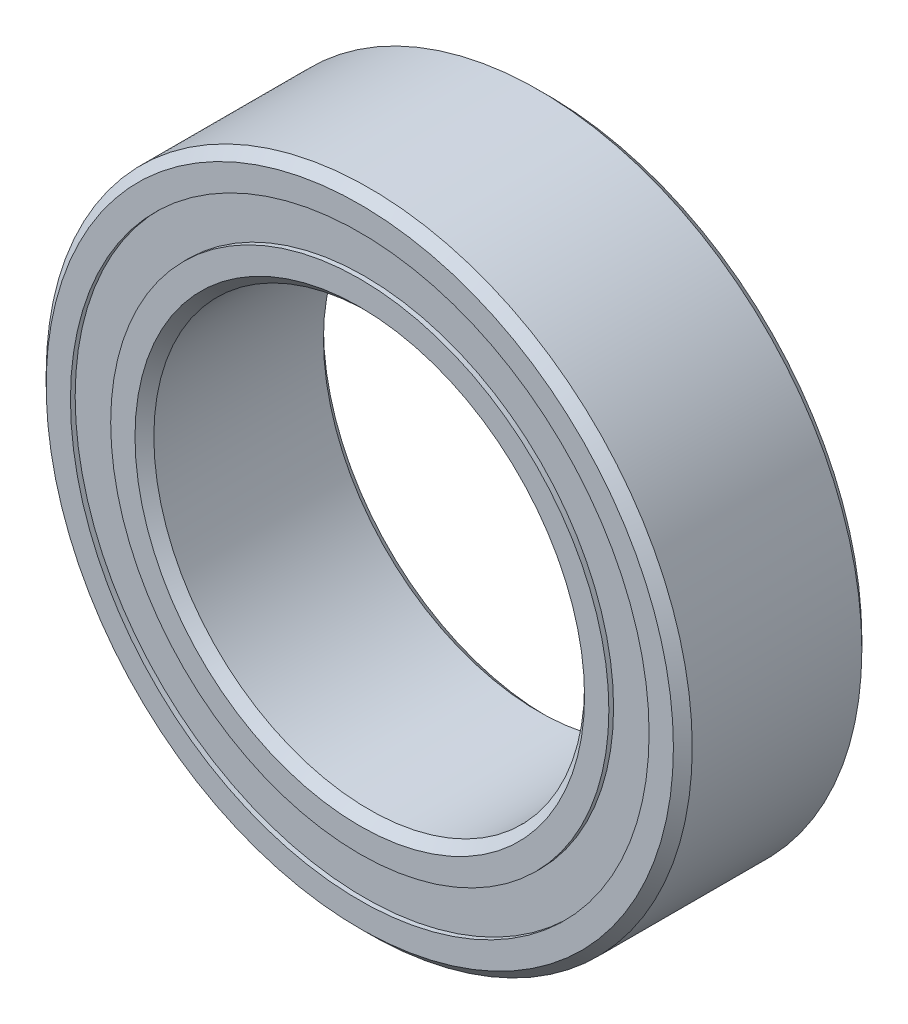
ISO-10303-21;
HEADER;
FILE_DESCRIPTION(('STEP AP214'),'2;1');
FILE_NAME('part.step','',(''),(''),'','','');
FILE_SCHEMA(('AUTOMOTIVE_DESIGN { 1 0 10303 214 1 1 1 1 }'));
ENDSEC;
DATA;
#1=APPLICATION_CONTEXT('core data for automotive mechanical design processes');
#2=APPLICATION_PROTOCOL_DEFINITION('international standard','automotive_design',2000,#1);
#3=PRODUCT_CONTEXT('',#1,'mechanical');
#4=PRODUCT('Part','Part','',(#3));
#5=PRODUCT_RELATED_PRODUCT_CATEGORY('part','',(#4));
#6=PRODUCT_DEFINITION_FORMATION('','',#4);
#7=PRODUCT_DEFINITION_CONTEXT('part definition',#1,'design');
#8=PRODUCT_DEFINITION('design','',#6,#7);
#9=PRODUCT_DEFINITION_SHAPE('','',#8);
#10=(LENGTH_UNIT() NAMED_UNIT(*) SI_UNIT(.MILLI.,.METRE.));
#11=(NAMED_UNIT(*) PLANE_ANGLE_UNIT() SI_UNIT($,.RADIAN.));
#12=(NAMED_UNIT(*) SI_UNIT($,.STERADIAN.) SOLID_ANGLE_UNIT());
#13=UNCERTAINTY_MEASURE_WITH_UNIT(LENGTH_MEASURE(1.E-05),#10,'distance_accuracy_value','');
#14=(GEOMETRIC_REPRESENTATION_CONTEXT(3) GLOBAL_UNCERTAINTY_ASSIGNED_CONTEXT((#13)) GLOBAL_UNIT_ASSIGNED_CONTEXT((#10,
#11,#12)) REPRESENTATION_CONTEXT('',''));
#15=CARTESIAN_POINT('',(0.,0.,0.));
#16=DIRECTION('',(0.,0.,1.));
#17=DIRECTION('',(1.,0.,0.));
#18=AXIS2_PLACEMENT_3D('',#15,#16,#17);
#19=CARTESIAN_POINT('',(0.,5.37362637362637,-1.6625));
#20=DIRECTION('',(0.,0.,1.));
#21=DIRECTION('',(1.,0.,0.));
#22=AXIS2_PLACEMENT_3D('',#19,#20,#21);
#23=PLANE('',#22);
#24=CARTESIAN_POINT('',(0.,0.,-1.6625));
#25=DIRECTION('',(0.,0.,1.));
#26=DIRECTION('',(1.,0.,0.));
#27=AXIS2_PLACEMENT_3D('',#24,#25,#26);
#28=CIRCLE('',#27,5.37362637362637);
#29=CARTESIAN_POINT('',(5.37362637362637,0.,-1.6625));
#30=VERTEX_POINT('',#29);
#31=EDGE_CURVE('E56',#30,#30,#28,.T.);
#32=ORIENTED_EDGE('',*,*,#31,.F.);
#33=EDGE_LOOP('',(#32));
#34=FACE_BOUND('',#33,.T.);
#35=CARTESIAN_POINT('',(0.,0.,-1.6625));
#36=DIRECTION('',(0.,0.,1.));
#37=DIRECTION('',(1.,0.,0.));
#38=AXIS2_PLACEMENT_3D('',#35,#36,#37);
#39=CIRCLE('',#38,4.62637362637363);
#40=CARTESIAN_POINT('',(4.62637362637363,0.,-1.6625));
#41=VERTEX_POINT('',#40);
#42=EDGE_CURVE('E11',#41,#41,#39,.T.);
#43=ORIENTED_EDGE('',*,*,#42,.T.);
#44=EDGE_LOOP('',(#43));
#45=FACE_BOUND('',#44,.T.);
#46=ADVANCED_FACE('F42',(#34,#45),#23,.F.);
#47=CARTESIAN_POINT('',(0.,0.,1.75));
#48=DIRECTION('',(0.,0.,1.));
#49=DIRECTION('',(1.,0.,0.));
#50=AXIS2_PLACEMENT_3D('',#47,#48,#49);
#51=CYLINDRICAL_SURFACE('',#50,4.62637362637363);
#52=ORIENTED_EDGE('',*,*,#42,.F.);
#53=EDGE_LOOP('',(#52));
#54=FACE_BOUND('',#53,.T.);
#55=CARTESIAN_POINT('',(0.,0.,-0.862864380232568));
#56=DIRECTION('',(0.,0.,1.));
#57=DIRECTION('',(1.,0.,0.));
#58=AXIS2_PLACEMENT_3D('',#55,#56,#57);
#59=CIRCLE('',#58,4.62637362637363);
#60=CARTESIAN_POINT('',(4.62637362637363,0.,-0.862864380232568));
#61=VERTEX_POINT('',#60);
#62=EDGE_CURVE('E48',#61,#61,#59,.T.);
#63=ORIENTED_EDGE('',*,*,#62,.T.);
#64=EDGE_LOOP('',(#63));
#65=FACE_BOUND('',#64,.T.);
#66=ADVANCED_FACE('F65',(#54,#65),#51,.F.);
#67=CARTESIAN_POINT('',(0.,5.37362637362637,-0.862864380232568));
#68=DIRECTION('',(0.,0.,-1.));
#69=DIRECTION('',(-1.,0.,0.));
#70=AXIS2_PLACEMENT_3D('',#67,#68,#69);
#71=PLANE('',#70);
#72=ORIENTED_EDGE('',*,*,#62,.F.);
#73=EDGE_LOOP('',(#72));
#74=FACE_BOUND('',#73,.T.);
#75=CARTESIAN_POINT('',(0.,0.,-0.862864380232568));
#76=DIRECTION('',(0.,0.,1.));
#77=DIRECTION('',(1.,0.,0.));
#78=AXIS2_PLACEMENT_3D('',#75,#76,#77);
#79=CIRCLE('',#78,5.37362637362637);
#80=CARTESIAN_POINT('',(5.37362637362637,0.,-0.862864380232568));
#81=VERTEX_POINT('',#80);
#82=EDGE_CURVE('E52',#81,#81,#79,.T.);
#83=ORIENTED_EDGE('',*,*,#82,.T.);
#84=EDGE_LOOP('',(#83));
#85=FACE_BOUND('',#84,.T.);
#86=ADVANCED_FACE('F69',(#74,#85),#71,.F.);
#87=CARTESIAN_POINT('',(0.,0.,1.75));
#88=DIRECTION('',(0.,0.,1.));
#89=DIRECTION('',(1.,0.,0.));
#90=AXIS2_PLACEMENT_3D('',#87,#88,#89);
#91=CYLINDRICAL_SURFACE('',#90,5.37362637362637);
#92=ORIENTED_EDGE('',*,*,#82,.F.);
#93=EDGE_LOOP('',(#92));
#94=FACE_BOUND('',#93,.T.);
#95=ORIENTED_EDGE('',*,*,#31,.T.);
#96=EDGE_LOOP('',(#95));
#97=FACE_BOUND('',#96,.T.);
#98=ADVANCED_FACE('F62',(#94,#97),#91,.T.);
#99=CLOSED_SHELL('',(#46,#66,#86,#98));
#100=MANIFOLD_SOLID_BREP('B2',#99);
#101=CARTESIAN_POINT('',(0.,5.37362637362637,1.6625));
#102=DIRECTION('',(0.,0.,-1.));
#103=DIRECTION('',(-1.,0.,0.));
#104=AXIS2_PLACEMENT_3D('',#101,#102,#103);
#105=PLANE('',#104);
#106=CARTESIAN_POINT('',(0.,0.,1.6625));
#107=DIRECTION('',(0.,0.,1.));
#108=DIRECTION('',(1.,0.,0.));
#109=AXIS2_PLACEMENT_3D('',#106,#107,#108);
#110=CIRCLE('',#109,4.62637362637363);
#111=CARTESIAN_POINT('',(4.62637362637363,0.,1.6625));
#112=VERTEX_POINT('',#111);
#113=EDGE_CURVE('E41',#112,#112,#110,.T.);
#114=ORIENTED_EDGE('',*,*,#113,.F.);
#115=EDGE_LOOP('',(#114));
#116=FACE_BOUND('',#115,.T.);
#117=CARTESIAN_POINT('',(0.,0.,1.6625));
#118=DIRECTION('',(0.,0.,1.));
#119=DIRECTION('',(1.,0.,0.));
#120=AXIS2_PLACEMENT_3D('',#117,#118,#119);
#121=CIRCLE('',#120,5.37362637362637);
#122=CARTESIAN_POINT('',(5.37362637362637,0.,1.6625));
#123=VERTEX_POINT('',#122);
#124=EDGE_CURVE('E124',#123,#123,#121,.T.);
#125=ORIENTED_EDGE('',*,*,#124,.T.);
#126=EDGE_LOOP('',(#125));
#127=FACE_BOUND('',#126,.T.);
#128=ADVANCED_FACE('F110',(#116,#127),#105,.F.);
#129=CARTESIAN_POINT('',(0.,0.,1.75));
#130=DIRECTION('',(0.,0.,1.));
#131=DIRECTION('',(1.,0.,0.));
#132=AXIS2_PLACEMENT_3D('',#129,#130,#131);
#133=CYLINDRICAL_SURFACE('',#132,4.62637362637363);
#134=CARTESIAN_POINT('',(0.,0.,0.862864380232567));
#135=DIRECTION('',(0.,0.,1.));
#136=DIRECTION('',(1.,0.,0.));
#137=AXIS2_PLACEMENT_3D('',#134,#135,#136);
#138=CIRCLE('',#137,4.62637362637363);
#139=CARTESIAN_POINT('',(4.62637362637363,0.,0.862864380232567));
#140=VERTEX_POINT('',#139);
#141=EDGE_CURVE('E116',#140,#140,#138,.T.);
#142=ORIENTED_EDGE('',*,*,#141,.F.);
#143=EDGE_LOOP('',(#142));
#144=FACE_BOUND('',#143,.T.);
#145=ORIENTED_EDGE('',*,*,#113,.T.);
#146=EDGE_LOOP('',(#145));
#147=FACE_BOUND('',#146,.T.);
#148=ADVANCED_FACE('F139',(#144,#147),#133,.F.);
#149=CARTESIAN_POINT('',(0.,5.37362637362637,0.862864380232567));
#150=DIRECTION('',(0.,0.,1.));
#151=DIRECTION('',(1.,0.,0.));
#152=AXIS2_PLACEMENT_3D('',#149,#150,#151);
#153=PLANE('',#152);
#154=CARTESIAN_POINT('',(0.,0.,0.862864380232567));
#155=DIRECTION('',(0.,0.,1.));
#156=DIRECTION('',(1.,0.,0.));
#157=AXIS2_PLACEMENT_3D('',#154,#155,#156);
#158=CIRCLE('',#157,5.37362637362637);
#159=CARTESIAN_POINT('',(5.37362637362637,0.,0.862864380232567));
#160=VERTEX_POINT('',#159);
#161=EDGE_CURVE('E120',#160,#160,#158,.T.);
#162=ORIENTED_EDGE('',*,*,#161,.F.);
#163=EDGE_LOOP('',(#162));
#164=FACE_BOUND('',#163,.T.);
#165=ORIENTED_EDGE('',*,*,#141,.T.);
#166=EDGE_LOOP('',(#165));
#167=FACE_BOUND('',#166,.T.);
#168=ADVANCED_FACE('F134',(#164,#167),#153,.F.);
#169=CARTESIAN_POINT('',(0.,0.,1.75));
#170=DIRECTION('',(0.,0.,1.));
#171=DIRECTION('',(1.,0.,0.));
#172=AXIS2_PLACEMENT_3D('',#169,#170,#171);
#173=CYLINDRICAL_SURFACE('',#172,5.37362637362637);
#174=ORIENTED_EDGE('',*,*,#124,.F.);
#175=EDGE_LOOP('',(#174));
#176=FACE_BOUND('',#175,.T.);
#177=ORIENTED_EDGE('',*,*,#161,.T.);
#178=EDGE_LOOP('',(#177));
#179=FACE_BOUND('',#178,.T.);
#180=ADVANCED_FACE('F131',(#176,#179),#173,.T.);
#181=CLOSED_SHELL('',(#128,#148,#168,#180));
#182=MANIFOLD_SOLID_BREP('B6',#181);
#183=CARTESIAN_POINT('',(-2.49999999999994,4.33012701892223,0.));
#184=DIRECTION('',(0.,0.,1.));
#185=DIRECTION('',(0.499999999999989,-0.866025403784445,0.));
#186=AXIS2_PLACEMENT_3D('',#183,#184,#185);
#187=SPHERICAL_SURFACE('',#186,0.862864380232568);
#188=CARTESIAN_POINT('',(-2.49999999999994,4.33012701892223,0.862864380232567));
#189=VERTEX_POINT('',#188);
#190=VERTEX_LOOP('',#189);
#191=FACE_BOUND('',#190,.T.);
#192=ADVANCED_FACE('F178',(#191),#187,.T.);
#193=CLOSED_SHELL('',(#192));
#194=MANIFOLD_SOLID_BREP('B36',#193);
#195=CARTESIAN_POINT('',(-4.33012701892216,2.50000000000005,0.));
#196=DIRECTION('',(0.,0.,1.));
#197=DIRECTION('',(0.866025403784433,-0.50000000000001,0.));
#198=AXIS2_PLACEMENT_3D('',#195,#196,#197);
#199=SPHERICAL_SURFACE('',#198,0.862864380232568);
#200=CARTESIAN_POINT('',(-4.33012701892216,2.50000000000005,0.862864380232567));
#201=VERTEX_POINT('',#200);
#202=VERTEX_LOOP('',#201);
#203=FACE_BOUND('',#202,.T.);
#204=ADVANCED_FACE('F199',(#203),#199,.T.);
#205=CLOSED_SHELL('',(#204));
#206=MANIFOLD_SOLID_BREP('B106',#205);
#207=CARTESIAN_POINT('',(-5.,0.,0.));
#208=DIRECTION('',(0.,0.,1.));
#209=DIRECTION('',(1.,0.,0.));
#210=AXIS2_PLACEMENT_3D('',#207,#208,#209);
#211=SPHERICAL_SURFACE('',#210,0.862864380232568);
#212=CARTESIAN_POINT('',(-5.,0.,0.862864380232567));
#213=VERTEX_POINT('',#212);
#214=VERTEX_LOOP('',#213);
#215=FACE_BOUND('',#214,.T.);
#216=ADVANCED_FACE('F220',(#215),#211,.T.);
#217=CLOSED_SHELL('',(#216));
#218=MANIFOLD_SOLID_BREP('B174',#217);
#219=CARTESIAN_POINT('',(-4.33012701892222,-2.49999999999996,0.));
#220=DIRECTION('',(0.,0.,1.));
#221=DIRECTION('',(0.866025403784443,0.499999999999992,0.));
#222=AXIS2_PLACEMENT_3D('',#219,#220,#221);
#223=SPHERICAL_SURFACE('',#222,0.862864380232568);
#224=CARTESIAN_POINT('',(-4.33012701892222,-2.49999999999996,0.862864380232567));
#225=VERTEX_POINT('',#224);
#226=VERTEX_LOOP('',#225);
#227=FACE_BOUND('',#226,.T.);
#228=ADVANCED_FACE('F241',(#227),#223,.T.);
#229=CLOSED_SHELL('',(#228));
#230=MANIFOLD_SOLID_BREP('B195',#229);
#231=CARTESIAN_POINT('',(-2.50000000000004,-4.33012701892217,0.));
#232=DIRECTION('',(0.,0.,1.));
#233=DIRECTION('',(0.500000000000007,0.866025403784435,0.));
#234=AXIS2_PLACEMENT_3D('',#231,#232,#233);
#235=SPHERICAL_SURFACE('',#234,0.862864380232568);
#236=CARTESIAN_POINT('',(-2.50000000000004,-4.33012701892217,0.862864380232567));
#237=VERTEX_POINT('',#236);
#238=VERTEX_LOOP('',#237);
#239=FACE_BOUND('',#238,.T.);
#240=ADVANCED_FACE('F262',(#239),#235,.T.);
#241=CLOSED_SHELL('',(#240));
#242=MANIFOLD_SOLID_BREP('B216',#241);
#243=CARTESIAN_POINT('',(0.,-5.,0.));
#244=DIRECTION('',(0.,0.,1.));
#245=DIRECTION('',(0.,1.,0.));
#246=AXIS2_PLACEMENT_3D('',#243,#244,#245);
#247=SPHERICAL_SURFACE('',#246,0.862864380232568);
#248=CARTESIAN_POINT('',(0.,-5.,0.862864380232567));
#249=VERTEX_POINT('',#248);
#250=VERTEX_LOOP('',#249);
#251=FACE_BOUND('',#250,.T.);
#252=ADVANCED_FACE('F283',(#251),#247,.T.);
#253=CLOSED_SHELL('',(#252));
#254=MANIFOLD_SOLID_BREP('B237',#253);
#255=CARTESIAN_POINT('',(2.49999999999997,-4.33012701892221,0.));
#256=DIRECTION('',(0.,0.,1.));
#257=DIRECTION('',(-0.499999999999995,0.866025403784442,0.));
#258=AXIS2_PLACEMENT_3D('',#255,#256,#257);
#259=SPHERICAL_SURFACE('',#258,0.862864380232568);
#260=CARTESIAN_POINT('',(2.49999999999997,-4.33012701892221,0.862864380232567));
#261=VERTEX_POINT('',#260);
#262=VERTEX_LOOP('',#261);
#263=FACE_BOUND('',#262,.T.);
#264=ADVANCED_FACE('F304',(#263),#259,.T.);
#265=CLOSED_SHELL('',(#264));
#266=MANIFOLD_SOLID_BREP('B258',#265);
#267=CARTESIAN_POINT('',(4.33012701892218,-2.50000000000002,0.));
#268=DIRECTION('',(0.,0.,1.));
#269=DIRECTION('',(-0.866025403784436,0.500000000000004,0.));
#270=AXIS2_PLACEMENT_3D('',#267,#268,#269);
#271=SPHERICAL_SURFACE('',#270,0.862864380232568);
#272=CARTESIAN_POINT('',(4.33012701892218,-2.50000000000002,0.862864380232567));
#273=VERTEX_POINT('',#272);
#274=VERTEX_LOOP('',#273);
#275=FACE_BOUND('',#274,.T.);
#276=ADVANCED_FACE('F325',(#275),#271,.T.);
#277=CLOSED_SHELL('',(#276));
#278=MANIFOLD_SOLID_BREP('B279',#277);
#279=CARTESIAN_POINT('',(5.,0.,0.));
#280=DIRECTION('',(0.,0.,1.));
#281=DIRECTION('',(-1.,0.,0.));
#282=AXIS2_PLACEMENT_3D('',#279,#280,#281);
#283=SPHERICAL_SURFACE('',#282,0.862864380232568);
#284=CARTESIAN_POINT('',(5.,0.,0.862864380232567));
#285=VERTEX_POINT('',#284);
#286=VERTEX_LOOP('',#285);
#287=FACE_BOUND('',#286,.T.);
#288=ADVANCED_FACE('F346',(#287),#283,.T.);
#289=CLOSED_SHELL('',(#288));
#290=MANIFOLD_SOLID_BREP('B300',#289);
#291=CARTESIAN_POINT('',(4.3301270189222,2.49999999999999,0.));
#292=DIRECTION('',(0.,0.,1.));
#293=DIRECTION('',(-0.86602540378444,-0.499999999999998,0.));
#294=AXIS2_PLACEMENT_3D('',#291,#292,#293);
#295=SPHERICAL_SURFACE('',#294,0.862864380232568);
#296=CARTESIAN_POINT('',(4.3301270189222,2.49999999999999,0.862864380232567));
#297=VERTEX_POINT('',#296);
#298=VERTEX_LOOP('',#297);
#299=FACE_BOUND('',#298,.T.);
#300=ADVANCED_FACE('F367',(#299),#295,.T.);
#301=CLOSED_SHELL('',(#300));
#302=MANIFOLD_SOLID_BREP('B321',#301);
#303=CARTESIAN_POINT('',(2.50000000000001,4.33012701892219,0.));
#304=DIRECTION('',(0.,0.,1.));
#305=DIRECTION('',(-0.500000000000001,-0.866025403784438,0.));
#306=AXIS2_PLACEMENT_3D('',#303,#304,#305);
#307=SPHERICAL_SURFACE('',#306,0.862864380232568);
#308=CARTESIAN_POINT('',(2.50000000000001,4.33012701892219,0.862864380232567));
#309=VERTEX_POINT('',#308);
#310=VERTEX_LOOP('',#309);
#311=FACE_BOUND('',#310,.T.);
#312=ADVANCED_FACE('F388',(#311),#307,.T.);
#313=CLOSED_SHELL('',(#312));
#314=MANIFOLD_SOLID_BREP('B342',#313);
#315=CARTESIAN_POINT('',(0.,5.,0.));
#316=DIRECTION('',(0.,0.,1.));
#317=DIRECTION('',(0.,-1.,0.));
#318=AXIS2_PLACEMENT_3D('',#315,#316,#317);
#319=SPHERICAL_SURFACE('',#318,0.862864380232568);
#320=CARTESIAN_POINT('',(0.,5.,0.862864380232567));
#321=VERTEX_POINT('',#320);
#322=VERTEX_LOOP('',#321);
#323=FACE_BOUND('',#322,.T.);
#324=ADVANCED_FACE('F411',(#323),#319,.T.);
#325=CLOSED_SHELL('',(#324));
#326=MANIFOLD_SOLID_BREP('B363',#325);
#327=CARTESIAN_POINT('',(0.,4.62637362637363,1.75));
#328=DIRECTION('',(0.,0.,-1.));
#329=DIRECTION('',(-1.,0.,0.));
#330=AXIS2_PLACEMENT_3D('',#327,#328,#329);
#331=PLANE('',#330);
#332=CARTESIAN_POINT('',(0.,0.,1.75));
#333=DIRECTION('',(0.,0.,1.));
#334=DIRECTION('',(1.,0.,0.));
#335=AXIS2_PLACEMENT_3D('',#332,#333,#334);
#336=CIRCLE('',#335,4.175);
#337=CARTESIAN_POINT('',(4.175,0.,1.75));
#338=VERTEX_POINT('',#337);
#339=EDGE_CURVE('E459',#338,#338,#336,.T.);
#340=ORIENTED_EDGE('',*,*,#339,.F.);
#341=EDGE_LOOP('',(#340));
#342=FACE_BOUND('',#341,.T.);
#343=CARTESIAN_POINT('',(0.,0.,1.75));
#344=DIRECTION('',(0.,0.,1.));
#345=DIRECTION('',(1.,0.,0.));
#346=AXIS2_PLACEMENT_3D('',#343,#344,#345);
#347=CIRCLE('',#346,4.62637362637363);
#348=CARTESIAN_POINT('',(4.62637362637363,0.,1.75));
#349=VERTEX_POINT('',#348);
#350=EDGE_CURVE('E410',#349,#349,#347,.T.);
#351=ORIENTED_EDGE('',*,*,#350,.T.);
#352=EDGE_LOOP('',(#351));
#353=FACE_BOUND('',#352,.T.);
#354=ADVANCED_FACE('F431',(#342,#353),#331,.F.);
#355=CARTESIAN_POINT('',(0.,0.,1.75));
#356=DIRECTION('',(0.,0.,1.));
#357=DIRECTION('',(1.,0.,0.));
#358=AXIS2_PLACEMENT_3D('',#355,#356,#357);
#359=CYLINDRICAL_SURFACE('',#358,4.62637362637363);
#360=ORIENTED_EDGE('',*,*,#350,.F.);
#361=EDGE_LOOP('',(#360));
#362=FACE_BOUND('',#361,.T.);
#363=CARTESIAN_POINT('',(0.,0.,0.777777777777777));
#364=DIRECTION('',(0.,0.,1.));
#365=DIRECTION('',(1.,0.,0.));
#366=AXIS2_PLACEMENT_3D('',#363,#364,#365);
#367=CIRCLE('',#366,4.62637362637363);
#368=CARTESIAN_POINT('',(4.62637362637363,0.,0.777777777777777));
#369=VERTEX_POINT('',#368);
#370=EDGE_CURVE('E437',#369,#369,#367,.T.);
#371=ORIENTED_EDGE('',*,*,#370,.T.);
#372=EDGE_LOOP('',(#371));
#373=FACE_BOUND('',#372,.T.);
#374=ADVANCED_FACE('F466',(#362,#373),#359,.T.);
#375=CARTESIAN_POINT('',(0.,0.,0.));
#376=DIRECTION('',(0.,0.,1.));
#377=DIRECTION('',(1.,0.,0.));
#378=AXIS2_PLACEMENT_3D('',#375,#376,#377);
#379=TOROIDAL_SURFACE('',#378,5.,0.862864380232566);
#380=ORIENTED_EDGE('',*,*,#370,.F.);
#381=EDGE_LOOP('',(#380));
#382=FACE_BOUND('',#381,.T.);
#383=CARTESIAN_POINT('',(0.,0.,-0.777777777777779));
#384=DIRECTION('',(0.,0.,1.));
#385=DIRECTION('',(1.,0.,0.));
#386=AXIS2_PLACEMENT_3D('',#383,#384,#385);
#387=CIRCLE('',#386,4.62637362637362);
#388=CARTESIAN_POINT('',(4.62637362637362,0.,-0.777777777777779));
#389=VERTEX_POINT('',#388);
#390=EDGE_CURVE('E441',#389,#389,#387,.T.);
#391=ORIENTED_EDGE('',*,*,#390,.T.);
#392=EDGE_LOOP('',(#391));
#393=FACE_BOUND('',#392,.T.);
#394=ADVANCED_FACE('F470',(#382,#393),#379,.F.);
#395=CARTESIAN_POINT('',(0.,0.,1.75));
#396=DIRECTION('',(0.,0.,1.));
#397=DIRECTION('',(1.,0.,0.));
#398=AXIS2_PLACEMENT_3D('',#395,#396,#397);
#399=CYLINDRICAL_SURFACE('',#398,4.62637362637362);
#400=ORIENTED_EDGE('',*,*,#390,.F.);
#401=EDGE_LOOP('',(#400));
#402=FACE_BOUND('',#401,.T.);
#403=CARTESIAN_POINT('',(0.,0.,-1.75));
#404=DIRECTION('',(0.,0.,1.));
#405=DIRECTION('',(1.,0.,0.));
#406=AXIS2_PLACEMENT_3D('',#403,#404,#405);
#407=CIRCLE('',#406,4.62637362637363);
#408=CARTESIAN_POINT('',(4.62637362637363,0.,-1.75));
#409=VERTEX_POINT('',#408);
#410=EDGE_CURVE('E445',#409,#409,#407,.T.);
#411=ORIENTED_EDGE('',*,*,#410,.T.);
#412=EDGE_LOOP('',(#411));
#413=FACE_BOUND('',#412,.T.);
#414=ADVANCED_FACE('F475',(#402,#413),#399,.T.);
#415=CARTESIAN_POINT('',(0.,4.175,-1.75));
#416=DIRECTION('',(0.,0.,1.));
#417=DIRECTION('',(1.,0.,0.));
#418=AXIS2_PLACEMENT_3D('',#415,#416,#417);
#419=PLANE('',#418);
#420=ORIENTED_EDGE('',*,*,#410,.F.);
#421=EDGE_LOOP('',(#420));
#422=FACE_BOUND('',#421,.T.);
#423=CARTESIAN_POINT('',(0.,0.,-1.75));
#424=DIRECTION('',(0.,0.,1.));
#425=DIRECTION('',(1.,0.,0.));
#426=AXIS2_PLACEMENT_3D('',#423,#424,#425);
#427=CIRCLE('',#426,4.175);
#428=CARTESIAN_POINT('',(4.175,0.,-1.75));
#429=VERTEX_POINT('',#428);
#430=EDGE_CURVE('E450',#429,#429,#427,.T.);
#431=ORIENTED_EDGE('',*,*,#430,.T.);
#432=EDGE_LOOP('',(#431));
#433=FACE_BOUND('',#432,.T.);
#434=ADVANCED_FACE('F481',(#422,#433),#419,.F.);
#435=CARTESIAN_POINT('',(0.,0.,-1.575));
#436=DIRECTION('',(0.,0.,-1.));
#437=DIRECTION('',(-1.,0.,0.));
#438=AXIS2_PLACEMENT_3D('',#435,#436,#437);
#439=CONICAL_SURFACE('',#438,4.,0.785398163397448);
#440=ORIENTED_EDGE('',*,*,#430,.F.);
#441=EDGE_LOOP('',(#440));
#442=FACE_BOUND('',#441,.T.);
#443=CARTESIAN_POINT('',(0.,0.,-1.575));
#444=DIRECTION('',(0.,0.,1.));
#445=DIRECTION('',(1.,0.,0.));
#446=AXIS2_PLACEMENT_3D('',#443,#444,#445);
#447=CIRCLE('',#446,4.);
#448=CARTESIAN_POINT('',(4.,0.,-1.575));
#449=VERTEX_POINT('',#448);
#450=EDGE_CURVE('E453',#449,#449,#447,.T.);
#451=ORIENTED_EDGE('',*,*,#450,.T.);
#452=EDGE_LOOP('',(#451));
#453=FACE_BOUND('',#452,.T.);
#454=ADVANCED_FACE('F485',(#442,#453),#439,.F.);
#455=CARTESIAN_POINT('',(0.,0.,1.75));
#456=DIRECTION('',(0.,0.,1.));
#457=DIRECTION('',(1.,0.,0.));
#458=AXIS2_PLACEMENT_3D('',#455,#456,#457);
#459=CYLINDRICAL_SURFACE('',#458,4.);
#460=ORIENTED_EDGE('',*,*,#450,.F.);
#461=EDGE_LOOP('',(#460));
#462=FACE_BOUND('',#461,.T.);
#463=CARTESIAN_POINT('',(0.,0.,1.575));
#464=DIRECTION('',(0.,0.,1.));
#465=DIRECTION('',(1.,0.,0.));
#466=AXIS2_PLACEMENT_3D('',#463,#464,#465);
#467=CIRCLE('',#466,4.);
#468=CARTESIAN_POINT('',(4.,0.,1.575));
#469=VERTEX_POINT('',#468);
#470=EDGE_CURVE('E456',#469,#469,#467,.T.);
#471=ORIENTED_EDGE('',*,*,#470,.T.);
#472=EDGE_LOOP('',(#471));
#473=FACE_BOUND('',#472,.T.);
#474=ADVANCED_FACE('F489',(#462,#473),#459,.F.);
#475=CARTESIAN_POINT('',(0.,0.,1.75));
#476=DIRECTION('',(0.,0.,1.));
#477=DIRECTION('',(1.,0.,0.));
#478=AXIS2_PLACEMENT_3D('',#475,#476,#477);
#479=CONICAL_SURFACE('',#478,4.175,0.785398163397447);
#480=ORIENTED_EDGE('',*,*,#470,.F.);
#481=EDGE_LOOP('',(#480));
#482=FACE_BOUND('',#481,.T.);
#483=ORIENTED_EDGE('',*,*,#339,.T.);
#484=EDGE_LOOP('',(#483));
#485=FACE_BOUND('',#484,.T.);
#486=ADVANCED_FACE('F463',(#482,#485),#479,.F.);
#487=CLOSED_SHELL('',(#354,#374,#394,#414,#434,#454,#474,#486));
#488=MANIFOLD_SOLID_BREP('B384',#487);
#489=CARTESIAN_POINT('',(0.,0.,1.575));
#490=DIRECTION('',(0.,0.,-1.));
#491=DIRECTION('',(-1.,0.,0.));
#492=AXIS2_PLACEMENT_3D('',#489,#490,#491);
#493=CONICAL_SURFACE('',#492,6.,0.78539816339745);
#494=CARTESIAN_POINT('',(0.,0.,1.75));
#495=DIRECTION('',(0.,0.,1.));
#496=DIRECTION('',(1.,0.,0.));
#497=AXIS2_PLACEMENT_3D('',#494,#495,#496);
#498=CIRCLE('',#497,5.825);
#499=CARTESIAN_POINT('',(5.825,0.,1.75));
#500=VERTEX_POINT('',#499);
#501=EDGE_CURVE('E581',#500,#500,#498,.T.);
#502=ORIENTED_EDGE('',*,*,#501,.F.);
#503=EDGE_LOOP('',(#502));
#504=FACE_BOUND('',#503,.T.);
#505=CARTESIAN_POINT('',(0.,0.,1.575));
#506=DIRECTION('',(0.,0.,1.));
#507=DIRECTION('',(1.,0.,0.));
#508=AXIS2_PLACEMENT_3D('',#505,#506,#507);
#509=CIRCLE('',#508,6.);
#510=CARTESIAN_POINT('',(6.,0.,1.575));
#511=VERTEX_POINT('',#510);
#512=EDGE_CURVE('E430',#511,#511,#509,.T.);
#513=ORIENTED_EDGE('',*,*,#512,.T.);
#514=EDGE_LOOP('',(#513));
#515=FACE_BOUND('',#514,.T.);
#516=ADVANCED_FACE('F553',(#504,#515),#493,.T.);
#517=CARTESIAN_POINT('',(0.,0.,1.75));
#518=DIRECTION('',(0.,0.,1.));
#519=DIRECTION('',(1.,0.,0.));
#520=AXIS2_PLACEMENT_3D('',#517,#518,#519);
#521=CYLINDRICAL_SURFACE('',#520,6.);
#522=ORIENTED_EDGE('',*,*,#512,.F.);
#523=EDGE_LOOP('',(#522));
#524=FACE_BOUND('',#523,.T.);
#525=CARTESIAN_POINT('',(0.,0.,-1.575));
#526=DIRECTION('',(0.,0.,1.));
#527=DIRECTION('',(1.,0.,0.));
#528=AXIS2_PLACEMENT_3D('',#525,#526,#527);
#529=CIRCLE('',#528,6.);
#530=CARTESIAN_POINT('',(6.,0.,-1.575));
#531=VERTEX_POINT('',#530);
#532=EDGE_CURVE('E559',#531,#531,#529,.T.);
#533=ORIENTED_EDGE('',*,*,#532,.T.);
#534=EDGE_LOOP('',(#533));
#535=FACE_BOUND('',#534,.T.);
#536=ADVANCED_FACE('F588',(#524,#535),#521,.T.);
#537=CARTESIAN_POINT('',(0.,0.,-1.75));
#538=DIRECTION('',(0.,0.,1.));
#539=DIRECTION('',(1.,0.,0.));
#540=AXIS2_PLACEMENT_3D('',#537,#538,#539);
#541=CONICAL_SURFACE('',#540,5.825,0.78539816339745);
#542=ORIENTED_EDGE('',*,*,#532,.F.);
#543=EDGE_LOOP('',(#542));
#544=FACE_BOUND('',#543,.T.);
#545=CARTESIAN_POINT('',(0.,0.,-1.75));
#546=DIRECTION('',(0.,0.,1.));
#547=DIRECTION('',(1.,0.,0.));
#548=AXIS2_PLACEMENT_3D('',#545,#546,#547);
#549=CIRCLE('',#548,5.825);
#550=CARTESIAN_POINT('',(5.825,0.,-1.75));
#551=VERTEX_POINT('',#550);
#552=EDGE_CURVE('E563',#551,#551,#549,.T.);
#553=ORIENTED_EDGE('',*,*,#552,.T.);
#554=EDGE_LOOP('',(#553));
#555=FACE_BOUND('',#554,.T.);
#556=ADVANCED_FACE('F592',(#544,#555),#541,.T.);
#557=CARTESIAN_POINT('',(0.,5.825,-1.75));
#558=DIRECTION('',(0.,0.,1.));
#559=DIRECTION('',(1.,0.,0.));
#560=AXIS2_PLACEMENT_3D('',#557,#558,#559);
#561=PLANE('',#560);
#562=ORIENTED_EDGE('',*,*,#552,.F.);
#563=EDGE_LOOP('',(#562));
#564=FACE_BOUND('',#563,.T.);
#565=CARTESIAN_POINT('',(0.,0.,-1.75));
#566=DIRECTION('',(0.,0.,1.));
#567=DIRECTION('',(1.,0.,0.));
#568=AXIS2_PLACEMENT_3D('',#565,#566,#567);
#569=CIRCLE('',#568,5.37362637362637);
#570=CARTESIAN_POINT('',(5.37362637362637,0.,-1.75));
#571=VERTEX_POINT('',#570);
#572=EDGE_CURVE('E567',#571,#571,#569,.T.);
#573=ORIENTED_EDGE('',*,*,#572,.T.);
#574=EDGE_LOOP('',(#573));
#575=FACE_BOUND('',#574,.T.);
#576=ADVANCED_FACE('F597',(#564,#575),#561,.F.);
#577=CARTESIAN_POINT('',(0.,0.,1.75));
#578=DIRECTION('',(0.,0.,1.));
#579=DIRECTION('',(1.,0.,0.));
#580=AXIS2_PLACEMENT_3D('',#577,#578,#579);
#581=CYLINDRICAL_SURFACE('',#580,5.37362637362637);
#582=ORIENTED_EDGE('',*,*,#572,.F.);
#583=EDGE_LOOP('',(#582));
#584=FACE_BOUND('',#583,.T.);
#585=CARTESIAN_POINT('',(0.,0.,-0.777777777777778));
#586=DIRECTION('',(0.,0.,1.));
#587=DIRECTION('',(1.,0.,0.));
#588=AXIS2_PLACEMENT_3D('',#585,#586,#587);
#589=CIRCLE('',#588,5.37362637362637);
#590=CARTESIAN_POINT('',(5.37362637362637,0.,-0.777777777777778));
#591=VERTEX_POINT('',#590);
#592=EDGE_CURVE('E572',#591,#591,#589,.T.);
#593=ORIENTED_EDGE('',*,*,#592,.T.);
#594=EDGE_LOOP('',(#593));
#595=FACE_BOUND('',#594,.T.);
#596=ADVANCED_FACE('F603',(#584,#595),#581,.F.);
#597=CARTESIAN_POINT('',(0.,0.,0.));
#598=DIRECTION('',(0.,0.,1.));
#599=DIRECTION('',(1.,0.,0.));
#600=AXIS2_PLACEMENT_3D('',#597,#598,#599);
#601=TOROIDAL_SURFACE('',#600,5.,0.862864380232568);
#602=ORIENTED_EDGE('',*,*,#592,.F.);
#603=EDGE_LOOP('',(#602));
#604=FACE_BOUND('',#603,.T.);
#605=CARTESIAN_POINT('',(0.,0.,0.777777777777777));
#606=DIRECTION('',(0.,0.,1.));
#607=DIRECTION('',(1.,0.,0.));
#608=AXIS2_PLACEMENT_3D('',#605,#606,#607);
#609=CIRCLE('',#608,5.37362637362637);
#610=CARTESIAN_POINT('',(5.37362637362637,0.,0.777777777777777));
#611=VERTEX_POINT('',#610);
#612=EDGE_CURVE('E575',#611,#611,#609,.T.);
#613=ORIENTED_EDGE('',*,*,#612,.T.);
#614=EDGE_LOOP('',(#613));
#615=FACE_BOUND('',#614,.T.);
#616=ADVANCED_FACE('F607',(#604,#615),#601,.F.);
#617=CARTESIAN_POINT('',(0.,0.,1.75));
#618=DIRECTION('',(0.,0.,1.));
#619=DIRECTION('',(1.,0.,0.));
#620=AXIS2_PLACEMENT_3D('',#617,#618,#619);
#621=CYLINDRICAL_SURFACE('',#620,5.37362637362637);
#622=ORIENTED_EDGE('',*,*,#612,.F.);
#623=EDGE_LOOP('',(#622));
#624=FACE_BOUND('',#623,.T.);
#625=CARTESIAN_POINT('',(0.,0.,1.75));
#626=DIRECTION('',(0.,0.,1.));
#627=DIRECTION('',(1.,0.,0.));
#628=AXIS2_PLACEMENT_3D('',#625,#626,#627);
#629=CIRCLE('',#628,5.37362637362637);
#630=CARTESIAN_POINT('',(5.37362637362637,0.,1.75));
#631=VERTEX_POINT('',#630);
#632=EDGE_CURVE('E578',#631,#631,#629,.T.);
#633=ORIENTED_EDGE('',*,*,#632,.T.);
#634=EDGE_LOOP('',(#633));
#635=FACE_BOUND('',#634,.T.);
#636=ADVANCED_FACE('F611',(#624,#635),#621,.F.);
#637=CARTESIAN_POINT('',(0.,5.825,1.75));
#638=DIRECTION('',(0.,0.,-1.));
#639=DIRECTION('',(-1.,0.,0.));
#640=AXIS2_PLACEMENT_3D('',#637,#638,#639);
#641=PLANE('',#640);
#642=ORIENTED_EDGE('',*,*,#632,.F.);
#643=EDGE_LOOP('',(#642));
#644=FACE_BOUND('',#643,.T.);
#645=ORIENTED_EDGE('',*,*,#501,.T.);
#646=EDGE_LOOP('',(#645));
#647=FACE_BOUND('',#646,.T.);
#648=ADVANCED_FACE('F585',(#644,#647),#641,.F.);
#649=CLOSED_SHELL('',(#516,#536,#556,#576,#596,#616,#636,#648));
#650=MANIFOLD_SOLID_BREP('B405',#649);
#651=ADVANCED_BREP_SHAPE_REPRESENTATION('',(#18,#100,#182,#194,#206,#218,#230,#242,#254,#266,
#278,#290,#302,#314,#326,#488,#650),#14);
#652=SHAPE_DEFINITION_REPRESENTATION(#9,#651);
ENDSEC;
END-ISO-10303-21;
